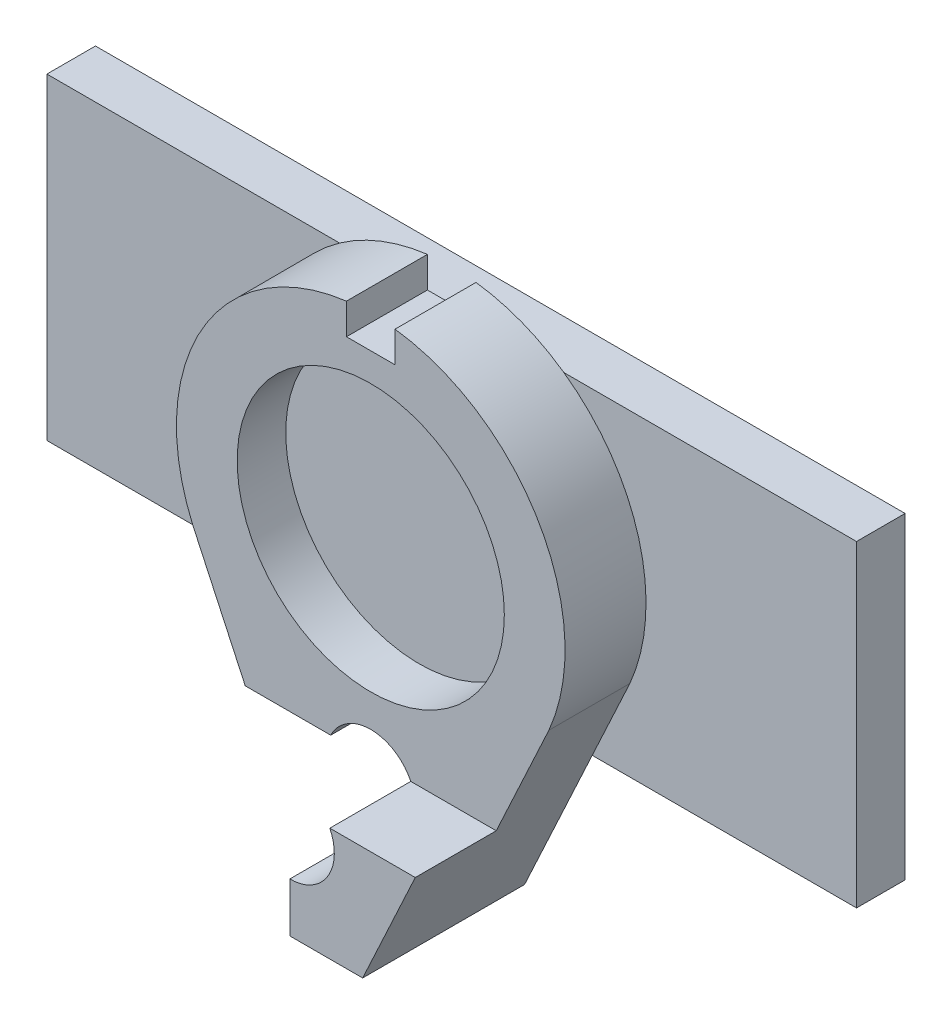
ISO-10303-21;
HEADER;
FILE_DESCRIPTION(('STEP AP214'),'2;1');
FILE_NAME('part.step','',(''),(''),'','','');
FILE_SCHEMA(('AUTOMOTIVE_DESIGN { 1 0 10303 214 1 1 1 1 }'));
ENDSEC;
DATA;
#1=APPLICATION_CONTEXT('core data for automotive mechanical design processes');
#2=APPLICATION_PROTOCOL_DEFINITION('international standard','automotive_design',2000,#1);
#3=PRODUCT_CONTEXT('',#1,'mechanical');
#4=PRODUCT('Part','Part','',(#3));
#5=PRODUCT_RELATED_PRODUCT_CATEGORY('part','',(#4));
#6=PRODUCT_DEFINITION_FORMATION('','',#4);
#7=PRODUCT_DEFINITION_CONTEXT('part definition',#1,'design');
#8=PRODUCT_DEFINITION('design','',#6,#7);
#9=PRODUCT_DEFINITION_SHAPE('','',#8);
#10=(LENGTH_UNIT() NAMED_UNIT(*) SI_UNIT(.MILLI.,.METRE.));
#11=(NAMED_UNIT(*) PLANE_ANGLE_UNIT() SI_UNIT($,.RADIAN.));
#12=(NAMED_UNIT(*) SI_UNIT($,.STERADIAN.) SOLID_ANGLE_UNIT());
#13=UNCERTAINTY_MEASURE_WITH_UNIT(LENGTH_MEASURE(1.E-05),#10,'distance_accuracy_value','');
#14=(GEOMETRIC_REPRESENTATION_CONTEXT(3) GLOBAL_UNCERTAINTY_ASSIGNED_CONTEXT((#13)) GLOBAL_UNIT_ASSIGNED_CONTEXT((#10,
#11,#12)) REPRESENTATION_CONTEXT('',''));
#15=CARTESIAN_POINT('',(0.,0.,0.));
#16=DIRECTION('',(0.,0.,1.));
#17=DIRECTION('',(1.,0.,0.));
#18=AXIS2_PLACEMENT_3D('',#15,#16,#17);
#19=CARTESIAN_POINT('',(0.,0.,0.));
#20=DIRECTION('',(0.,0.,-1.));
#21=DIRECTION('',(-1.,0.,0.));
#22=AXIS2_PLACEMENT_3D('',#19,#20,#21);
#23=PLANE('',#22);
#24=CARTESIAN_POINT('',(0.,-13.,0.));
#25=DIRECTION('',(0.,0.,-1.));
#26=DIRECTION('',(-1.,0.,0.));
#27=AXIS2_PLACEMENT_3D('',#24,#25,#26);
#28=CIRCLE('',#27,2.75);
#29=CARTESIAN_POINT('',(-2.47234267037416,-11.7958315233128,0.));
#30=VERTEX_POINT('',#29);
#31=CARTESIAN_POINT('',(0.,-15.75,0.));
#32=VERTEX_POINT('',#31);
#33=EDGE_CURVE('E177',#30,#32,#28,.T.);
#34=ORIENTED_EDGE('',*,*,#33,.F.);
#35=DIRECTION('',(-1.,0.,0.));
#36=VECTOR('',#35,1.);
#37=CARTESIAN_POINT('',(0.,-11.7958315233128,0.));
#38=LINE('',#37,#36);
#39=CARTESIAN_POINT('',(-7.75,-11.7958315233128,0.));
#40=VERTEX_POINT('',#39);
#41=EDGE_CURVE('E308',#30,#40,#38,.T.);
#42=ORIENTED_EDGE('',*,*,#41,.T.);
#43=DIRECTION('',(0.421111306454626,-0.907008967748433,0.));
#44=VECTOR('',#43,1.);
#45=CARTESIAN_POINT('',(-11.,-4.79583152331272,0.));
#46=LINE('',#45,#44);
#47=CARTESIAN_POINT('',(-8.67663606439521,-9.8,0.));
#48=VERTEX_POINT('',#47);
#49=EDGE_CURVE('E240',#48,#40,#46,.T.);
#50=ORIENTED_EDGE('',*,*,#49,.F.);
#51=DIRECTION('',(-1.,0.,0.));
#52=VECTOR('',#51,1.);
#53=CARTESIAN_POINT('',(-25.,-9.79999999999999,0.));
#54=LINE('',#53,#52);
#55=CARTESIAN_POINT('',(8.67663606439521,-9.8,0.));
#56=VERTEX_POINT('',#55);
#57=EDGE_CURVE('E40',#56,#48,#54,.T.);
#58=ORIENTED_EDGE('',*,*,#57,.F.);
#59=DIRECTION('',(0.421111306454627,0.907008967748433,0.));
#60=VECTOR('',#59,1.);
#61=CARTESIAN_POINT('',(11.,-4.79583152331272,0.));
#62=LINE('',#61,#60);
#63=CARTESIAN_POINT('',(4.5,-18.7958315233128,0.));
#64=VERTEX_POINT('',#63);
#65=EDGE_CURVE('E249',#64,#56,#62,.T.);
#66=ORIENTED_EDGE('',*,*,#65,.F.);
#67=DIRECTION('',(1.,0.,0.));
#68=VECTOR('',#67,1.);
#69=CARTESIAN_POINT('',(-4.50000000000001,-18.7958315233128,0.));
#70=LINE('',#69,#68);
#71=CARTESIAN_POINT('',(0.,-18.7958315233128,0.));
#72=VERTEX_POINT('',#71);
#73=EDGE_CURVE('E246',#72,#64,#70,.T.);
#74=ORIENTED_EDGE('',*,*,#73,.F.);
#75=DIRECTION('',(0.,1.,0.));
#76=VECTOR('',#75,1.);
#77=CARTESIAN_POINT('',(0.,-18.7958315233128,0.));
#78=LINE('',#77,#76);
#79=EDGE_CURVE('E304',#72,#32,#78,.T.);
#80=ORIENTED_EDGE('',*,*,#79,.T.);
#81=EDGE_LOOP('',(#34,#42,#50,#58,#66,#74,#80));
#82=FACE_BOUND('',#81,.T.);
#83=ADVANCED_FACE('F32',(#82),#23,.T.);
#84=CARTESIAN_POINT('',(0.,0.,5.));
#85=DIRECTION('',(0.,0.,-1.));
#86=DIRECTION('',(-1.,0.,0.));
#87=AXIS2_PLACEMENT_3D('',#84,#85,#86);
#88=PLANE('',#87);
#89=CARTESIAN_POINT('',(0.,0.,5.));
#90=DIRECTION('',(0.,0.,1.));
#91=DIRECTION('',(1.,0.,0.));
#92=AXIS2_PLACEMENT_3D('',#89,#90,#91);
#93=CIRCLE('',#92,8.25);
#94=CARTESIAN_POINT('',(8.25,0.,5.));
#95=VERTEX_POINT('',#94);
#96=EDGE_CURVE('E221',#95,#95,#93,.T.);
#97=ORIENTED_EDGE('',*,*,#96,.F.);
#98=EDGE_LOOP('',(#97));
#99=FACE_BOUND('',#98,.T.);
#100=DIRECTION('',(-1.,0.,0.));
#101=VECTOR('',#100,1.);
#102=CARTESIAN_POINT('',(0.,-11.7958315233128,5.));
#103=LINE('',#102,#101);
#104=CARTESIAN_POINT('',(-2.47234267037416,-11.7958315233128,5.));
#105=VERTEX_POINT('',#104);
#106=CARTESIAN_POINT('',(-7.75,-11.7958315233128,5.));
#107=VERTEX_POINT('',#106);
#108=EDGE_CURVE('E300',#105,#107,#103,.T.);
#109=ORIENTED_EDGE('',*,*,#108,.F.);
#110=CARTESIAN_POINT('',(0.,-13.,5.));
#111=DIRECTION('',(0.,0.,-1.));
#112=DIRECTION('',(-1.,0.,0.));
#113=AXIS2_PLACEMENT_3D('',#110,#111,#112);
#114=CIRCLE('',#113,2.75);
#115=CARTESIAN_POINT('',(2.47234267037417,-11.7958315233128,5.));
#116=VERTEX_POINT('',#115);
#117=EDGE_CURVE('E47',#105,#116,#114,.T.);
#118=ORIENTED_EDGE('',*,*,#117,.T.);
#119=DIRECTION('',(-1.,0.,0.));
#120=VECTOR('',#119,1.);
#121=CARTESIAN_POINT('',(7.74999999999997,-11.7958315233128,5.));
#122=LINE('',#121,#120);
#123=CARTESIAN_POINT('',(7.74999999999997,-11.7958315233128,5.));
#124=VERTEX_POINT('',#123);
#125=EDGE_CURVE('E176',#124,#116,#122,.T.);
#126=ORIENTED_EDGE('',*,*,#125,.F.);
#127=DIRECTION('',(0.421111306454627,0.907008967748433,0.));
#128=VECTOR('',#127,1.);
#129=CARTESIAN_POINT('',(11.,-4.79583152331272,5.));
#130=LINE('',#129,#128);
#131=CARTESIAN_POINT('',(11.,-4.79583152331272,5.));
#132=VERTEX_POINT('',#131);
#133=EDGE_CURVE('E235',#124,#132,#130,.T.);
#134=ORIENTED_EDGE('',*,*,#133,.T.);
#135=CARTESIAN_POINT('',(0.,0.,5.));
#136=DIRECTION('',(0.,0.,1.));
#137=DIRECTION('',(-1.,0.,0.));
#138=AXIS2_PLACEMENT_3D('',#135,#136,#137);
#139=CIRCLE('',#138,12.);
#140=CARTESIAN_POINT('',(1.5,11.9058808997907,5.));
#141=VERTEX_POINT('',#140);
#142=EDGE_CURVE('E228',#132,#141,#139,.T.);
#143=ORIENTED_EDGE('',*,*,#142,.T.);
#144=DIRECTION('',(0.,1.,0.));
#145=VECTOR('',#144,1.);
#146=CARTESIAN_POINT('',(1.5,10.,5.));
#147=LINE('',#146,#145);
#148=CARTESIAN_POINT('',(1.5,10.,5.));
#149=VERTEX_POINT('',#148);
#150=EDGE_CURVE('E206',#149,#141,#147,.T.);
#151=ORIENTED_EDGE('',*,*,#150,.F.);
#152=DIRECTION('',(-1.,0.,0.));
#153=VECTOR('',#152,1.);
#154=CARTESIAN_POINT('',(1.5,10.,5.));
#155=LINE('',#154,#153);
#156=CARTESIAN_POINT('',(-1.5,10.,5.));
#157=VERTEX_POINT('',#156);
#158=EDGE_CURVE('E196',#149,#157,#155,.T.);
#159=ORIENTED_EDGE('',*,*,#158,.T.);
#160=DIRECTION('',(0.,1.,0.));
#161=VECTOR('',#160,1.);
#162=CARTESIAN_POINT('',(-1.5,10.,5.));
#163=LINE('',#162,#161);
#164=CARTESIAN_POINT('',(-1.5,11.9058808997907,5.));
#165=VERTEX_POINT('',#164);
#166=EDGE_CURVE('E213',#157,#165,#163,.T.);
#167=ORIENTED_EDGE('',*,*,#166,.T.);
#168=CARTESIAN_POINT('',(-11.,-4.79583152331272,5.));
#169=VERTEX_POINT('',#168);
#170=EDGE_CURVE('E232',#165,#169,#139,.T.);
#171=ORIENTED_EDGE('',*,*,#170,.T.);
#172=DIRECTION('',(0.421111306454626,-0.907008967748433,0.));
#173=VECTOR('',#172,1.);
#174=CARTESIAN_POINT('',(-11.,-4.79583152331272,5.));
#175=LINE('',#174,#173);
#176=EDGE_CURVE('E231',#169,#107,#175,.T.);
#177=ORIENTED_EDGE('',*,*,#176,.T.);
#178=EDGE_LOOP('',(#109,#118,#126,#134,#143,#151,#159,#167,#171,#177));
#179=FACE_BOUND('',#178,.T.);
#180=ADVANCED_FACE('F298',(#99,#179),#88,.F.);
#181=CARTESIAN_POINT('',(0.,0.,5.));
#182=DIRECTION('',(0.,0.,-1.));
#183=DIRECTION('',(-1.,0.,0.));
#184=AXIS2_PLACEMENT_3D('',#181,#182,#183);
#185=CYLINDRICAL_SURFACE('',#184,12.);
#186=DIRECTION('',(0.,0.,-1.));
#187=VECTOR('',#186,1.);
#188=CARTESIAN_POINT('',(-1.5,11.9058808997907,5.));
#189=LINE('',#188,#187);
#190=CARTESIAN_POINT('',(-1.5,11.9058808997907,0.));
#191=VERTEX_POINT('',#190);
#192=EDGE_CURVE('E219',#191,#165,#189,.F.);
#193=ORIENTED_EDGE('',*,*,#192,.F.);
#194=CARTESIAN_POINT('',(0.,0.,0.));
#195=DIRECTION('',(0.,0.,1.));
#196=DIRECTION('',(-1.,0.,0.));
#197=AXIS2_PLACEMENT_3D('',#194,#195,#196);
#198=CIRCLE('',#197,12.);
#199=CARTESIAN_POINT('',(-6.9253158772723,9.80000000000001,0.));
#200=VERTEX_POINT('',#199);
#201=EDGE_CURVE('E242',#191,#200,#198,.T.);
#202=ORIENTED_EDGE('',*,*,#201,.T.);
#203=CARTESIAN_POINT('',(-11.,-4.79583152331272,0.));
#204=VERTEX_POINT('',#203);
#205=EDGE_CURVE('E225',#200,#204,#198,.T.);
#206=ORIENTED_EDGE('',*,*,#205,.T.);
#207=DIRECTION('',(0.,0.,-1.));
#208=VECTOR('',#207,1.);
#209=CARTESIAN_POINT('',(-11.,-4.79583152331272,5.));
#210=LINE('',#209,#208);
#211=EDGE_CURVE('E255',#169,#204,#210,.T.);
#212=ORIENTED_EDGE('',*,*,#211,.F.);
#213=ORIENTED_EDGE('',*,*,#170,.F.);
#214=EDGE_LOOP('',(#193,#202,#206,#212,#213));
#215=FACE_BOUND('',#214,.T.);
#216=ADVANCED_FACE('F34',(#215),#185,.T.);
#217=CARTESIAN_POINT('',(11.,-4.79583152331272,0.));
#218=VERTEX_POINT('',#217);
#219=CARTESIAN_POINT('',(6.92531587727231,9.8,0.));
#220=VERTEX_POINT('',#219);
#221=EDGE_CURVE('E238',#218,#220,#198,.T.);
#222=ORIENTED_EDGE('',*,*,#221,.T.);
#223=CARTESIAN_POINT('',(1.5,11.9058808997907,0.));
#224=VERTEX_POINT('',#223);
#225=EDGE_CURVE('E241',#220,#224,#198,.T.);
#226=ORIENTED_EDGE('',*,*,#225,.T.);
#227=DIRECTION('',(0.,0.,-1.));
#228=VECTOR('',#227,1.);
#229=CARTESIAN_POINT('',(1.5,11.9058808997907,5.));
#230=LINE('',#229,#228);
#231=EDGE_CURVE('E216',#224,#141,#230,.F.);
#232=ORIENTED_EDGE('',*,*,#231,.T.);
#233=ORIENTED_EDGE('',*,*,#142,.F.);
#234=DIRECTION('',(0.,0.,-1.));
#235=VECTOR('',#234,1.);
#236=CARTESIAN_POINT('',(11.,-4.79583152331272,5.));
#237=LINE('',#236,#235);
#238=EDGE_CURVE('E237',#132,#218,#237,.T.);
#239=ORIENTED_EDGE('',*,*,#238,.T.);
#240=EDGE_LOOP('',(#222,#226,#232,#233,#239));
#241=FACE_BOUND('',#240,.T.);
#242=ADVANCED_FACE('F325',(#241),#185,.T.);
#243=DIRECTION('',(1.,0.,0.));
#244=VECTOR('',#243,1.);
#245=CARTESIAN_POINT('',(-25.,9.80000000000001,0.));
#246=LINE('',#245,#244);
#247=EDGE_CURVE('E257',#200,#220,#246,.T.);
#248=ORIENTED_EDGE('',*,*,#247,.F.);
#249=ORIENTED_EDGE('',*,*,#201,.F.);
#250=DIRECTION('',(0.,1.,0.));
#251=VECTOR('',#250,1.);
#252=CARTESIAN_POINT('',(-1.5,10.,0.));
#253=LINE('',#252,#251);
#254=CARTESIAN_POINT('',(-1.5,10.,0.));
#255=VERTEX_POINT('',#254);
#256=EDGE_CURVE('E211',#255,#191,#253,.T.);
#257=ORIENTED_EDGE('',*,*,#256,.F.);
#258=DIRECTION('',(-1.,0.,0.));
#259=VECTOR('',#258,1.);
#260=CARTESIAN_POINT('',(1.5,10.,0.));
#261=LINE('',#260,#259);
#262=CARTESIAN_POINT('',(1.5,10.,0.));
#263=VERTEX_POINT('',#262);
#264=EDGE_CURVE('E201',#263,#255,#261,.T.);
#265=ORIENTED_EDGE('',*,*,#264,.F.);
#266=DIRECTION('',(0.,1.,0.));
#267=VECTOR('',#266,1.);
#268=CARTESIAN_POINT('',(1.5,10.,0.));
#269=LINE('',#268,#267);
#270=EDGE_CURVE('E208',#263,#224,#269,.T.);
#271=ORIENTED_EDGE('',*,*,#270,.T.);
#272=ORIENTED_EDGE('',*,*,#225,.F.);
#273=EDGE_LOOP('',(#248,#249,#257,#265,#271,#272));
#274=FACE_BOUND('',#273,.T.);
#275=ADVANCED_FACE('F335',(#274),#23,.T.);
#276=CARTESIAN_POINT('',(-11.,-4.79583152331272,5.));
#277=DIRECTION('',(0.907008967748433,0.421111306454626,0.));
#278=DIRECTION('',(-0.421111306454626,0.907008967748433,0.));
#279=AXIS2_PLACEMENT_3D('',#276,#277,#278);
#280=PLANE('',#279);
#281=EDGE_CURVE('E243',#204,#48,#46,.T.);
#282=ORIENTED_EDGE('',*,*,#281,.T.);
#283=ORIENTED_EDGE('',*,*,#49,.T.);
#284=DIRECTION('',(0.,0.,1.));
#285=VECTOR('',#284,1.);
#286=CARTESIAN_POINT('',(-7.75,-11.7958315233128,0.));
#287=LINE('',#286,#285);
#288=EDGE_CURVE('E193',#40,#107,#287,.T.);
#289=ORIENTED_EDGE('',*,*,#288,.T.);
#290=ORIENTED_EDGE('',*,*,#176,.F.);
#291=ORIENTED_EDGE('',*,*,#211,.T.);
#292=EDGE_LOOP('',(#282,#283,#289,#290,#291));
#293=FACE_BOUND('',#292,.T.);
#294=ADVANCED_FACE('F397',(#293),#280,.F.);
#295=CARTESIAN_POINT('',(-4.50000000000001,-18.7958315233128,5.));
#296=DIRECTION('',(0.,1.,0.));
#297=DIRECTION('',(0.,0.,1.));
#298=AXIS2_PLACEMENT_3D('',#295,#296,#297);
#299=PLANE('',#298);
#300=DIRECTION('',(0.,0.,-1.));
#301=VECTOR('',#300,1.);
#302=CARTESIAN_POINT('',(0.,-18.7958315233128,10.));
#303=LINE('',#302,#301);
#304=CARTESIAN_POINT('',(0.,-18.7958315233128,10.));
#305=VERTEX_POINT('',#304);
#306=EDGE_CURVE('E186',#305,#72,#303,.T.);
#307=ORIENTED_EDGE('',*,*,#306,.T.);
#308=ORIENTED_EDGE('',*,*,#73,.T.);
#309=DIRECTION('',(0.,0.,-1.));
#310=VECTOR('',#309,1.);
#311=CARTESIAN_POINT('',(4.5,-18.7958315233128,5.));
#312=LINE('',#311,#310);
#313=CARTESIAN_POINT('',(4.5,-18.7958315233128,10.));
#314=VERTEX_POINT('',#313);
#315=EDGE_CURVE('E253',#314,#64,#312,.T.);
#316=ORIENTED_EDGE('',*,*,#315,.F.);
#317=DIRECTION('',(1.,0.,0.));
#318=VECTOR('',#317,1.);
#319=CARTESIAN_POINT('',(0.,-18.7958315233128,10.));
#320=LINE('',#319,#318);
#321=EDGE_CURVE('E188',#305,#314,#320,.T.);
#322=ORIENTED_EDGE('',*,*,#321,.F.);
#323=EDGE_LOOP('',(#307,#308,#316,#322));
#324=FACE_BOUND('',#323,.T.);
#325=ADVANCED_FACE('F377',(#324),#299,.F.);
#326=CARTESIAN_POINT('',(11.,-4.79583152331272,5.));
#327=DIRECTION('',(-0.907008967748433,0.421111306454627,0.));
#328=DIRECTION('',(-0.421111306454627,-0.907008967748433,0.));
#329=AXIS2_PLACEMENT_3D('',#326,#327,#328);
#330=PLANE('',#329);
#331=ORIENTED_EDGE('',*,*,#65,.T.);
#332=EDGE_CURVE('E248',#56,#218,#62,.T.);
#333=ORIENTED_EDGE('',*,*,#332,.T.);
#334=ORIENTED_EDGE('',*,*,#238,.F.);
#335=ORIENTED_EDGE('',*,*,#133,.F.);
#336=DIRECTION('',(0.,0.,-1.));
#337=VECTOR('',#336,1.);
#338=CARTESIAN_POINT('',(7.74999999999997,-11.7958315233128,10.));
#339=LINE('',#338,#337);
#340=CARTESIAN_POINT('',(7.74999999999997,-11.7958315233128,10.));
#341=VERTEX_POINT('',#340);
#342=EDGE_CURVE('E184',#341,#124,#339,.T.);
#343=ORIENTED_EDGE('',*,*,#342,.F.);
#344=DIRECTION('',(0.421111306454627,0.907008967748433,0.));
#345=VECTOR('',#344,1.);
#346=CARTESIAN_POINT('',(4.5,-18.7958315233128,10.));
#347=LINE('',#346,#345);
#348=EDGE_CURVE('E182',#314,#341,#347,.T.);
#349=ORIENTED_EDGE('',*,*,#348,.F.);
#350=ORIENTED_EDGE('',*,*,#315,.T.);
#351=EDGE_LOOP('',(#331,#333,#334,#335,#343,#349,#350));
#352=FACE_BOUND('',#351,.T.);
#353=ADVANCED_FACE('F320',(#352),#330,.F.);
#354=CARTESIAN_POINT('',(0.,0.,2.));
#355=DIRECTION('',(0.,0.,1.));
#356=DIRECTION('',(1.,0.,0.));
#357=AXIS2_PLACEMENT_3D('',#354,#355,#356);
#358=CYLINDRICAL_SURFACE('',#357,8.25);
#359=CARTESIAN_POINT('',(0.,0.,2.));
#360=DIRECTION('',(0.,0.,1.));
#361=DIRECTION('',(1.,0.,0.));
#362=AXIS2_PLACEMENT_3D('',#359,#360,#361);
#363=CIRCLE('',#362,8.25);
#364=CARTESIAN_POINT('',(8.25,0.,2.));
#365=VERTEX_POINT('',#364);
#366=EDGE_CURVE('E222',#365,#365,#363,.T.);
#367=ORIENTED_EDGE('',*,*,#366,.F.);
#368=EDGE_LOOP('',(#367));
#369=FACE_BOUND('',#368,.T.);
#370=ORIENTED_EDGE('',*,*,#96,.T.);
#371=EDGE_LOOP('',(#370));
#372=FACE_BOUND('',#371,.T.);
#373=ADVANCED_FACE('F504',(#369,#372),#358,.F.);
#374=CARTESIAN_POINT('',(0.,0.,2.));
#375=DIRECTION('',(0.,0.,1.));
#376=DIRECTION('',(1.,0.,0.));
#377=AXIS2_PLACEMENT_3D('',#374,#375,#376);
#378=PLANE('',#377);
#379=ORIENTED_EDGE('',*,*,#366,.T.);
#380=EDGE_LOOP('',(#379));
#381=FACE_BOUND('',#380,.T.);
#382=ADVANCED_FACE('F535',(#381),#378,.T.);
#383=CARTESIAN_POINT('',(-1.5,10.,5.));
#384=DIRECTION('',(1.,0.,0.));
#385=DIRECTION('',(0.,0.,-1.));
#386=AXIS2_PLACEMENT_3D('',#383,#384,#385);
#387=PLANE('',#386);
#388=ORIENTED_EDGE('',*,*,#192,.T.);
#389=ORIENTED_EDGE('',*,*,#166,.F.);
#390=DIRECTION('',(0.,0.,-1.));
#391=VECTOR('',#390,1.);
#392=CARTESIAN_POINT('',(-1.5,10.,5.));
#393=LINE('',#392,#391);
#394=EDGE_CURVE('E199',#157,#255,#393,.T.);
#395=ORIENTED_EDGE('',*,*,#394,.T.);
#396=ORIENTED_EDGE('',*,*,#256,.T.);
#397=EDGE_LOOP('',(#388,#389,#395,#396));
#398=FACE_BOUND('',#397,.T.);
#399=ADVANCED_FACE('F529',(#398),#387,.T.);
#400=CARTESIAN_POINT('',(1.5,10.,5.));
#401=DIRECTION('',(1.,0.,0.));
#402=DIRECTION('',(0.,0.,-1.));
#403=AXIS2_PLACEMENT_3D('',#400,#401,#402);
#404=PLANE('',#403);
#405=ORIENTED_EDGE('',*,*,#270,.F.);
#406=DIRECTION('',(0.,0.,-1.));
#407=VECTOR('',#406,1.);
#408=CARTESIAN_POINT('',(1.5,10.,5.));
#409=LINE('',#408,#407);
#410=EDGE_CURVE('E204',#149,#263,#409,.T.);
#411=ORIENTED_EDGE('',*,*,#410,.F.);
#412=ORIENTED_EDGE('',*,*,#150,.T.);
#413=ORIENTED_EDGE('',*,*,#231,.F.);
#414=EDGE_LOOP('',(#405,#411,#412,#413));
#415=FACE_BOUND('',#414,.T.);
#416=ADVANCED_FACE('F331',(#415),#404,.F.);
#417=CARTESIAN_POINT('',(0.,10.,0.));
#418=DIRECTION('',(0.,-1.,0.));
#419=DIRECTION('',(0.,0.,-1.));
#420=AXIS2_PLACEMENT_3D('',#417,#418,#419);
#421=PLANE('',#420);
#422=ORIENTED_EDGE('',*,*,#158,.F.);
#423=ORIENTED_EDGE('',*,*,#410,.T.);
#424=ORIENTED_EDGE('',*,*,#264,.T.);
#425=ORIENTED_EDGE('',*,*,#394,.F.);
#426=EDGE_LOOP('',(#422,#423,#424,#425));
#427=FACE_BOUND('',#426,.T.);
#428=ADVANCED_FACE('F339',(#427),#421,.F.);
#429=CARTESIAN_POINT('',(0.,-11.7958315233128,10.));
#430=DIRECTION('',(1.,0.,0.));
#431=DIRECTION('',(0.,1.,0.));
#432=AXIS2_PLACEMENT_3D('',#429,#430,#431);
#433=PLANE('',#432);
#434=DIRECTION('',(0.,-1.,0.));
#435=VECTOR('',#434,1.);
#436=CARTESIAN_POINT('',(0.,-11.7958315233128,10.));
#437=LINE('',#436,#435);
#438=CARTESIAN_POINT('',(0.,-15.75,10.));
#439=VERTEX_POINT('',#438);
#440=EDGE_CURVE('E192',#439,#305,#437,.T.);
#441=ORIENTED_EDGE('',*,*,#440,.F.);
#442=DIRECTION('',(0.,0.,1.));
#443=VECTOR('',#442,1.);
#444=CARTESIAN_POINT('',(0.,-15.75,-3.));
#445=LINE('',#444,#443);
#446=EDGE_CURVE('E165',#439,#32,#445,.F.);
#447=ORIENTED_EDGE('',*,*,#446,.T.);
#448=ORIENTED_EDGE('',*,*,#79,.F.);
#449=ORIENTED_EDGE('',*,*,#306,.F.);
#450=EDGE_LOOP('',(#441,#447,#448,#449));
#451=FACE_BOUND('',#450,.T.);
#452=ADVANCED_FACE('F379',(#451),#433,.F.);
#453=CARTESIAN_POINT('',(7.74999999999997,-11.7958315233128,10.));
#454=DIRECTION('',(0.,-1.,0.));
#455=DIRECTION('',(0.,0.,-1.));
#456=AXIS2_PLACEMENT_3D('',#453,#454,#455);
#457=PLANE('',#456);
#458=ORIENTED_EDGE('',*,*,#125,.T.);
#459=DIRECTION('',(0.,0.,1.));
#460=VECTOR('',#459,1.);
#461=CARTESIAN_POINT('',(2.47234267037417,-11.7958315233128,-3.));
#462=LINE('',#461,#460);
#463=CARTESIAN_POINT('',(2.47234267037417,-11.7958315233128,10.));
#464=VERTEX_POINT('',#463);
#465=EDGE_CURVE('E163',#116,#464,#462,.T.);
#466=ORIENTED_EDGE('',*,*,#465,.T.);
#467=DIRECTION('',(-1.,0.,0.));
#468=VECTOR('',#467,1.);
#469=CARTESIAN_POINT('',(7.74999999999997,-11.7958315233128,10.));
#470=LINE('',#469,#468);
#471=EDGE_CURVE('E175',#341,#464,#470,.T.);
#472=ORIENTED_EDGE('',*,*,#471,.F.);
#473=ORIENTED_EDGE('',*,*,#342,.T.);
#474=EDGE_LOOP('',(#458,#466,#472,#473));
#475=FACE_BOUND('',#474,.T.);
#476=ADVANCED_FACE('F173',(#475),#457,.F.);
#477=CARTESIAN_POINT('',(0.,0.,10.));
#478=DIRECTION('',(0.,0.,1.));
#479=DIRECTION('',(1.,0.,0.));
#480=AXIS2_PLACEMENT_3D('',#477,#478,#479);
#481=PLANE('',#480);
#482=CARTESIAN_POINT('',(0.,-13.,10.));
#483=DIRECTION('',(0.,0.,1.));
#484=DIRECTION('',(1.,0.,0.));
#485=AXIS2_PLACEMENT_3D('',#482,#483,#484);
#486=CIRCLE('',#485,2.75);
#487=EDGE_CURVE('E160',#439,#464,#486,.T.);
#488=ORIENTED_EDGE('',*,*,#487,.F.);
#489=ORIENTED_EDGE('',*,*,#440,.T.);
#490=ORIENTED_EDGE('',*,*,#321,.T.);
#491=ORIENTED_EDGE('',*,*,#348,.T.);
#492=ORIENTED_EDGE('',*,*,#471,.T.);
#493=EDGE_LOOP('',(#488,#489,#490,#491,#492));
#494=FACE_BOUND('',#493,.T.);
#495=ADVANCED_FACE('F179',(#494),#481,.T.);
#496=CARTESIAN_POINT('',(0.,-11.7958315233128,0.));
#497=DIRECTION('',(0.,1.,0.));
#498=DIRECTION('',(-1.,0.,0.));
#499=AXIS2_PLACEMENT_3D('',#496,#497,#498);
#500=PLANE('',#499);
#501=ORIENTED_EDGE('',*,*,#41,.F.);
#502=DIRECTION('',(0.,0.,1.));
#503=VECTOR('',#502,1.);
#504=CARTESIAN_POINT('',(-2.47234267037416,-11.7958315233128,-3.));
#505=LINE('',#504,#503);
#506=EDGE_CURVE('E11',#30,#105,#505,.T.);
#507=ORIENTED_EDGE('',*,*,#506,.T.);
#508=ORIENTED_EDGE('',*,*,#108,.T.);
#509=ORIENTED_EDGE('',*,*,#288,.F.);
#510=EDGE_LOOP('',(#501,#507,#508,#509));
#511=FACE_BOUND('',#510,.T.);
#512=ADVANCED_FACE('F438',(#511),#500,.F.);
#513=CARTESIAN_POINT('',(0.,0.,0.));
#514=DIRECTION('',(0.,0.,1.));
#515=DIRECTION('',(1.,0.,0.));
#516=AXIS2_PLACEMENT_3D('',#513,#514,#515);
#517=PLANE('',#516);
#518=ORIENTED_EDGE('',*,*,#281,.F.);
#519=ORIENTED_EDGE('',*,*,#205,.F.);
#520=CARTESIAN_POINT('',(-25.,9.80000000000001,0.));
#521=VERTEX_POINT('',#520);
#522=EDGE_CURVE('E264',#521,#200,#246,.T.);
#523=ORIENTED_EDGE('',*,*,#522,.F.);
#524=DIRECTION('',(0.,1.,0.));
#525=VECTOR('',#524,1.);
#526=CARTESIAN_POINT('',(-25.,9.80000000000001,0.));
#527=LINE('',#526,#525);
#528=CARTESIAN_POINT('',(-25.,-9.79999999999999,0.));
#529=VERTEX_POINT('',#528);
#530=EDGE_CURVE('E274',#529,#521,#527,.T.);
#531=ORIENTED_EDGE('',*,*,#530,.F.);
#532=EDGE_CURVE('E270',#48,#529,#54,.T.);
#533=ORIENTED_EDGE('',*,*,#532,.F.);
#534=EDGE_LOOP('',(#518,#519,#523,#531,#533));
#535=FACE_BOUND('',#534,.T.);
#536=ADVANCED_FACE('F348',(#535),#517,.T.);
#537=ORIENTED_EDGE('',*,*,#221,.F.);
#538=ORIENTED_EDGE('',*,*,#332,.F.);
#539=CARTESIAN_POINT('',(25.,-9.8,0.));
#540=VERTEX_POINT('',#539);
#541=EDGE_CURVE('E269',#540,#56,#54,.T.);
#542=ORIENTED_EDGE('',*,*,#541,.F.);
#543=DIRECTION('',(0.,-1.,0.));
#544=VECTOR('',#543,1.);
#545=CARTESIAN_POINT('',(25.,9.8,0.));
#546=LINE('',#545,#544);
#547=CARTESIAN_POINT('',(25.,9.8,0.));
#548=VERTEX_POINT('',#547);
#549=EDGE_CURVE('E273',#548,#540,#546,.T.);
#550=ORIENTED_EDGE('',*,*,#549,.F.);
#551=EDGE_CURVE('E265',#220,#548,#246,.T.);
#552=ORIENTED_EDGE('',*,*,#551,.F.);
#553=EDGE_LOOP('',(#537,#538,#542,#550,#552));
#554=FACE_BOUND('',#553,.T.);
#555=ADVANCED_FACE('F372',(#554),#517,.T.);
#556=CARTESIAN_POINT('',(-25.,9.80000000000001,-3.));
#557=DIRECTION('',(1.,0.,0.));
#558=DIRECTION('',(0.,1.,0.));
#559=AXIS2_PLACEMENT_3D('',#556,#557,#558);
#560=PLANE('',#559);
#561=ORIENTED_EDGE('',*,*,#530,.T.);
#562=DIRECTION('',(0.,0.,1.));
#563=VECTOR('',#562,1.);
#564=CARTESIAN_POINT('',(-25.,9.80000000000001,-3.));
#565=LINE('',#564,#563);
#566=CARTESIAN_POINT('',(-25.,9.80000000000001,-3.));
#567=VERTEX_POINT('',#566);
#568=EDGE_CURVE('E305',#567,#521,#565,.T.);
#569=ORIENTED_EDGE('',*,*,#568,.F.);
#570=DIRECTION('',(0.,1.,0.));
#571=VECTOR('',#570,1.);
#572=CARTESIAN_POINT('',(-25.,9.80000000000001,-3.));
#573=LINE('',#572,#571);
#574=CARTESIAN_POINT('',(-25.,-9.79999999999999,-3.));
#575=VERTEX_POINT('',#574);
#576=EDGE_CURVE('E292',#575,#567,#573,.T.);
#577=ORIENTED_EDGE('',*,*,#576,.F.);
#578=DIRECTION('',(0.,0.,1.));
#579=VECTOR('',#578,1.);
#580=CARTESIAN_POINT('',(-25.,-9.79999999999999,-3.));
#581=LINE('',#580,#579);
#582=EDGE_CURVE('E287',#575,#529,#581,.T.);
#583=ORIENTED_EDGE('',*,*,#582,.T.);
#584=EDGE_LOOP('',(#561,#569,#577,#583));
#585=FACE_BOUND('',#584,.T.);
#586=ADVANCED_FACE('F352',(#585),#560,.F.);
#587=CARTESIAN_POINT('',(-25.,9.80000000000001,-3.));
#588=DIRECTION('',(0.,-1.,0.));
#589=DIRECTION('',(1.,0.,0.));
#590=AXIS2_PLACEMENT_3D('',#587,#588,#589);
#591=PLANE('',#590);
#592=ORIENTED_EDGE('',*,*,#522,.T.);
#593=ORIENTED_EDGE('',*,*,#247,.T.);
#594=ORIENTED_EDGE('',*,*,#551,.T.);
#595=DIRECTION('',(0.,0.,1.));
#596=VECTOR('',#595,1.);
#597=CARTESIAN_POINT('',(25.,9.8,-3.));
#598=LINE('',#597,#596);
#599=CARTESIAN_POINT('',(25.,9.8,-3.));
#600=VERTEX_POINT('',#599);
#601=EDGE_CURVE('E311',#600,#548,#598,.T.);
#602=ORIENTED_EDGE('',*,*,#601,.F.);
#603=DIRECTION('',(1.,0.,0.));
#604=VECTOR('',#603,1.);
#605=CARTESIAN_POINT('',(-25.,9.80000000000001,-3.));
#606=LINE('',#605,#604);
#607=EDGE_CURVE('E290',#567,#600,#606,.T.);
#608=ORIENTED_EDGE('',*,*,#607,.F.);
#609=ORIENTED_EDGE('',*,*,#568,.T.);
#610=EDGE_LOOP('',(#592,#593,#594,#602,#608,#609));
#611=FACE_BOUND('',#610,.T.);
#612=ADVANCED_FACE('F350',(#611),#591,.F.);
#613=CARTESIAN_POINT('',(25.,9.8,-3.));
#614=DIRECTION('',(-1.,0.,0.));
#615=DIRECTION('',(0.,-1.,0.));
#616=AXIS2_PLACEMENT_3D('',#613,#614,#615);
#617=PLANE('',#616);
#618=ORIENTED_EDGE('',*,*,#549,.T.);
#619=DIRECTION('',(0.,0.,1.));
#620=VECTOR('',#619,1.);
#621=CARTESIAN_POINT('',(25.,-9.8,-3.));
#622=LINE('',#621,#620);
#623=CARTESIAN_POINT('',(25.,-9.8,-3.));
#624=VERTEX_POINT('',#623);
#625=EDGE_CURVE('E363',#624,#540,#622,.T.);
#626=ORIENTED_EDGE('',*,*,#625,.F.);
#627=DIRECTION('',(0.,-1.,0.));
#628=VECTOR('',#627,1.);
#629=CARTESIAN_POINT('',(25.,9.8,-3.));
#630=LINE('',#629,#628);
#631=EDGE_CURVE('E288',#600,#624,#630,.T.);
#632=ORIENTED_EDGE('',*,*,#631,.F.);
#633=ORIENTED_EDGE('',*,*,#601,.T.);
#634=EDGE_LOOP('',(#618,#626,#632,#633));
#635=FACE_BOUND('',#634,.T.);
#636=ADVANCED_FACE('F369',(#635),#617,.F.);
#637=CARTESIAN_POINT('',(-25.,-9.79999999999999,-3.));
#638=DIRECTION('',(0.,1.,0.));
#639=DIRECTION('',(-1.,0.,0.));
#640=AXIS2_PLACEMENT_3D('',#637,#638,#639);
#641=PLANE('',#640);
#642=ORIENTED_EDGE('',*,*,#541,.T.);
#643=ORIENTED_EDGE('',*,*,#57,.T.);
#644=ORIENTED_EDGE('',*,*,#532,.T.);
#645=ORIENTED_EDGE('',*,*,#582,.F.);
#646=DIRECTION('',(-1.,0.,0.));
#647=VECTOR('',#646,1.);
#648=CARTESIAN_POINT('',(-25.,-9.79999999999999,-3.));
#649=LINE('',#648,#647);
#650=EDGE_CURVE('E285',#624,#575,#649,.T.);
#651=ORIENTED_EDGE('',*,*,#650,.F.);
#652=ORIENTED_EDGE('',*,*,#625,.T.);
#653=EDGE_LOOP('',(#642,#643,#644,#645,#651,#652));
#654=FACE_BOUND('',#653,.T.);
#655=ADVANCED_FACE('F362',(#654),#641,.F.);
#656=CARTESIAN_POINT('',(0.,0.,-3.));
#657=DIRECTION('',(0.,0.,1.));
#658=DIRECTION('',(1.,0.,0.));
#659=AXIS2_PLACEMENT_3D('',#656,#657,#658);
#660=PLANE('',#659);
#661=ORIENTED_EDGE('',*,*,#576,.T.);
#662=ORIENTED_EDGE('',*,*,#607,.T.);
#663=ORIENTED_EDGE('',*,*,#631,.T.);
#664=ORIENTED_EDGE('',*,*,#650,.T.);
#665=EDGE_LOOP('',(#661,#662,#663,#664));
#666=FACE_BOUND('',#665,.T.);
#667=ADVANCED_FACE('F355',(#666),#660,.F.);
#668=CARTESIAN_POINT('',(0.,-13.,-3.));
#669=DIRECTION('',(0.,0.,1.));
#670=DIRECTION('',(1.,0.,0.));
#671=AXIS2_PLACEMENT_3D('',#668,#669,#670);
#672=CYLINDRICAL_SURFACE('',#671,2.75);
#673=ORIENTED_EDGE('',*,*,#487,.T.);
#674=ORIENTED_EDGE('',*,*,#465,.F.);
#675=ORIENTED_EDGE('',*,*,#117,.F.);
#676=ORIENTED_EDGE('',*,*,#506,.F.);
#677=ORIENTED_EDGE('',*,*,#33,.T.);
#678=ORIENTED_EDGE('',*,*,#446,.F.);
#679=EDGE_LOOP('',(#673,#674,#675,#676,#677,#678));
#680=FACE_BOUND('',#679,.T.);
#681=ADVANCED_FACE('F162',(#680),#672,.F.);
#682=CLOSED_SHELL('',(#83,#180,#216,#242,#275,#294,#325,#353,#373,#382,#399,#416,#428,#452,#476,
#495,#512,#536,#555,#586,#612,#636,#655,#667,#681));
#683=MANIFOLD_SOLID_BREP('B2',#682);
#684=ADVANCED_BREP_SHAPE_REPRESENTATION('',(#18,#683),#14);
#685=SHAPE_DEFINITION_REPRESENTATION(#9,#684);
ENDSEC;
END-ISO-10303-21;
